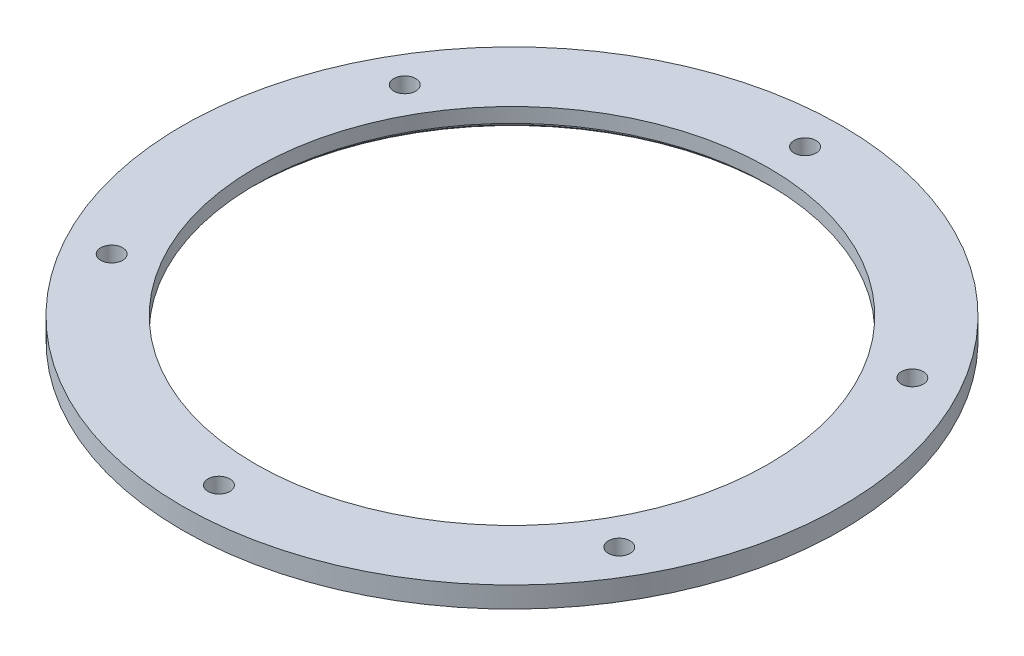
ISO-10303-21;
HEADER;
FILE_DESCRIPTION(('STEP AP214'),'2;1');
FILE_NAME('part.step','',(''),(''),'','','');
FILE_SCHEMA(('AUTOMOTIVE_DESIGN { 1 0 10303 214 1 1 1 1 }'));
ENDSEC;
DATA;
#1=APPLICATION_CONTEXT('core data for automotive mechanical design processes');
#2=APPLICATION_PROTOCOL_DEFINITION('international standard','automotive_design',2000,#1);
#3=PRODUCT_CONTEXT('',#1,'mechanical');
#4=PRODUCT('Part','Part','',(#3));
#5=PRODUCT_RELATED_PRODUCT_CATEGORY('part','',(#4));
#6=PRODUCT_DEFINITION_FORMATION('','',#4);
#7=PRODUCT_DEFINITION_CONTEXT('part definition',#1,'design');
#8=PRODUCT_DEFINITION('design','',#6,#7);
#9=PRODUCT_DEFINITION_SHAPE('','',#8);
#10=(LENGTH_UNIT() NAMED_UNIT(*) SI_UNIT(.MILLI.,.METRE.));
#11=(NAMED_UNIT(*) PLANE_ANGLE_UNIT() SI_UNIT($,.RADIAN.));
#12=(NAMED_UNIT(*) SI_UNIT($,.STERADIAN.) SOLID_ANGLE_UNIT());
#13=UNCERTAINTY_MEASURE_WITH_UNIT(LENGTH_MEASURE(1.E-05),#10,'distance_accuracy_value','');
#14=(GEOMETRIC_REPRESENTATION_CONTEXT(3) GLOBAL_UNCERTAINTY_ASSIGNED_CONTEXT((#13)) GLOBAL_UNIT_ASSIGNED_CONTEXT((#10,
#11,#12)) REPRESENTATION_CONTEXT('',''));
#15=CARTESIAN_POINT('',(0.,0.,0.));
#16=DIRECTION('',(0.,0.,1.));
#17=DIRECTION('',(1.,0.,0.));
#18=AXIS2_PLACEMENT_3D('',#15,#16,#17);
#19=CARTESIAN_POINT('',(0.,10.,0.));
#20=DIRECTION('',(0.,-1.,0.));
#21=DIRECTION('',(0.,0.,-1.));
#22=AXIS2_PLACEMENT_3D('',#19,#20,#21);
#23=CYLINDRICAL_SURFACE('',#22,123.);
#24=CARTESIAN_POINT('',(0.,10.,0.));
#25=DIRECTION('',(0.,1.,0.));
#26=DIRECTION('',(0.,0.,1.));
#27=AXIS2_PLACEMENT_3D('',#24,#25,#26);
#28=CIRCLE('',#27,123.);
#29=CARTESIAN_POINT('',(0.,10.,123.));
#30=VERTEX_POINT('',#29);
#31=EDGE_CURVE('E54',#30,#30,#28,.T.);
#32=ORIENTED_EDGE('',*,*,#31,.T.);
#33=EDGE_LOOP('',(#32));
#34=FACE_BOUND('',#33,.T.);
#35=CARTESIAN_POINT('',(0.,3.,0.));
#36=DIRECTION('',(0.,-1.,0.));
#37=DIRECTION('',(0.,0.,-1.));
#38=AXIS2_PLACEMENT_3D('',#35,#36,#37);
#39=CIRCLE('',#38,123.);
#40=CARTESIAN_POINT('',(0.,3.,-123.));
#41=VERTEX_POINT('',#40);
#42=EDGE_CURVE('E48',#41,#41,#39,.T.);
#43=ORIENTED_EDGE('',*,*,#42,.T.);
#44=EDGE_LOOP('',(#43));
#45=FACE_BOUND('',#44,.T.);
#46=ADVANCED_FACE('F30',(#34,#45),#23,.F.);
#47=CARTESIAN_POINT('',(0.,10.,0.));
#48=DIRECTION('',(0.,1.,0.));
#49=DIRECTION('',(0.,0.,1.));
#50=AXIS2_PLACEMENT_3D('',#47,#48,#49);
#51=PLANE('',#50);
#52=CARTESIAN_POINT('',(-121.676569231702,10.,70.250000000007));
#53=DIRECTION('',(0.,1.,0.));
#54=DIRECTION('',(0.,0.,1.));
#55=AXIS2_PLACEMENT_3D('',#52,#53,#54);
#56=CIRCLE('',#55,5.25000000001474);
#57=CARTESIAN_POINT('',(-121.676569231702,10.,75.5000000000217));
#58=VERTEX_POINT('',#57);
#59=EDGE_CURVE('E80',#58,#58,#56,.T.);
#60=ORIENTED_EDGE('',*,*,#59,.F.);
#61=EDGE_LOOP('',(#60));
#62=FACE_BOUND('',#61,.T.);
#63=CARTESIAN_POINT('',(121.676569231726,10.,70.2499999999931));
#64=DIRECTION('',(0.,1.,0.));
#65=DIRECTION('',(0.,0.,1.));
#66=AXIS2_PLACEMENT_3D('',#63,#64,#65);
#67=CIRCLE('',#66,5.25000000001009);
#68=CARTESIAN_POINT('',(121.676569231726,10.,75.5000000000032));
#69=VERTEX_POINT('',#68);
#70=EDGE_CURVE('E68',#69,#69,#67,.T.);
#71=ORIENTED_EDGE('',*,*,#70,.F.);
#72=EDGE_LOOP('',(#71));
#73=FACE_BOUND('',#72,.T.);
#74=CARTESIAN_POINT('',(0.,10.,-140.5));
#75=DIRECTION('',(0.,1.,0.));
#76=DIRECTION('',(0.,0.,1.));
#77=AXIS2_PLACEMENT_3D('',#74,#75,#76);
#78=CIRCLE('',#77,5.25);
#79=CARTESIAN_POINT('',(0.,10.,-135.25));
#80=VERTEX_POINT('',#79);
#81=EDGE_CURVE('E58',#80,#80,#78,.T.);
#82=ORIENTED_EDGE('',*,*,#81,.F.);
#83=EDGE_LOOP('',(#82));
#84=FACE_BOUND('',#83,.T.);
#85=CARTESIAN_POINT('',(0.,10.,0.));
#86=DIRECTION('',(0.,1.,0.));
#87=DIRECTION('',(0.,0.,1.));
#88=AXIS2_PLACEMENT_3D('',#85,#86,#87);
#89=CIRCLE('',#88,158.);
#90=CARTESIAN_POINT('',(0.,10.,158.));
#91=VERTEX_POINT('',#90);
#92=EDGE_CURVE('E41',#91,#91,#89,.T.);
#93=ORIENTED_EDGE('',*,*,#92,.T.);
#94=EDGE_LOOP('',(#93));
#95=FACE_BOUND('',#94,.T.);
#96=ORIENTED_EDGE('',*,*,#31,.F.);
#97=EDGE_LOOP('',(#96));
#98=FACE_BOUND('',#97,.T.);
#99=CARTESIAN_POINT('',(121.676569231718,10.,-70.2500000000069));
#100=DIRECTION('',(0.,1.,0.));
#101=DIRECTION('',(0.,0.,1.));
#102=AXIS2_PLACEMENT_3D('',#99,#100,#101);
#103=CIRCLE('',#102,5.25000000000215);
#104=CARTESIAN_POINT('',(121.676569231718,10.,-65.0000000000048));
#105=VERTEX_POINT('',#104);
#106=EDGE_CURVE('E62',#105,#105,#103,.T.);
#107=ORIENTED_EDGE('',*,*,#106,.F.);
#108=EDGE_LOOP('',(#107));
#109=FACE_BOUND('',#108,.T.);
#110=CARTESIAN_POINT('',(1.5938588124831E-11,10.,140.5));
#111=DIRECTION('',(0.,1.,0.));
#112=DIRECTION('',(0.,0.,1.));
#113=AXIS2_PLACEMENT_3D('',#110,#111,#112);
#114=CIRCLE('',#113,5.25000000001619);
#115=CARTESIAN_POINT('',(1.5938588124831E-11,10.,145.750000000016));
#116=VERTEX_POINT('',#115);
#117=EDGE_CURVE('E74',#116,#116,#114,.T.);
#118=ORIENTED_EDGE('',*,*,#117,.F.);
#119=EDGE_LOOP('',(#118));
#120=FACE_BOUND('',#119,.T.);
#121=CARTESIAN_POINT('',(-121.67656923171,10.,-70.249999999993));
#122=DIRECTION('',(0.,1.,0.));
#123=DIRECTION('',(0.,0.,1.));
#124=AXIS2_PLACEMENT_3D('',#121,#122,#123);
#125=CIRCLE('',#124,5.2500000000075);
#126=CARTESIAN_POINT('',(-121.67656923171,10.,-64.9999999999855));
#127=VERTEX_POINT('',#126);
#128=EDGE_CURVE('E86',#127,#127,#125,.T.);
#129=ORIENTED_EDGE('',*,*,#128,.F.);
#130=EDGE_LOOP('',(#129));
#131=FACE_BOUND('',#130,.T.);
#132=ADVANCED_FACE('F112',(#62,#73,#84,#95,#98,#109,#120,#131),#51,.T.);
#133=CARTESIAN_POINT('',(0.,0.,0.));
#134=DIRECTION('',(0.,1.,0.));
#135=DIRECTION('',(0.,0.,1.));
#136=AXIS2_PLACEMENT_3D('',#133,#134,#135);
#137=PLANE('',#136);
#138=CARTESIAN_POINT('',(0.,0.,0.));
#139=DIRECTION('',(0.,1.,0.));
#140=DIRECTION('',(0.,0.,1.));
#141=AXIS2_PLACEMENT_3D('',#138,#139,#140);
#142=CIRCLE('',#141,126.);
#143=CARTESIAN_POINT('',(0.,0.,126.));
#144=VERTEX_POINT('',#143);
#145=EDGE_CURVE('E10',#144,#144,#142,.T.);
#146=ORIENTED_EDGE('',*,*,#145,.T.);
#147=EDGE_LOOP('',(#146));
#148=FACE_BOUND('',#147,.T.);
#149=CARTESIAN_POINT('',(0.,0.,0.));
#150=DIRECTION('',(0.,1.,0.));
#151=DIRECTION('',(0.,0.,1.));
#152=AXIS2_PLACEMENT_3D('',#149,#150,#151);
#153=CIRCLE('',#152,158.);
#154=CARTESIAN_POINT('',(0.,0.,158.));
#155=VERTEX_POINT('',#154);
#156=EDGE_CURVE('E45',#155,#155,#153,.T.);
#157=ORIENTED_EDGE('',*,*,#156,.F.);
#158=EDGE_LOOP('',(#157));
#159=FACE_BOUND('',#158,.T.);
#160=CARTESIAN_POINT('',(0.,0.,-140.5));
#161=DIRECTION('',(0.,1.,0.));
#162=DIRECTION('',(0.,0.,1.));
#163=AXIS2_PLACEMENT_3D('',#160,#161,#162);
#164=CIRCLE('',#163,5.25);
#165=CARTESIAN_POINT('',(0.,0.,-135.25));
#166=VERTEX_POINT('',#165);
#167=EDGE_CURVE('E59',#166,#166,#164,.T.);
#168=ORIENTED_EDGE('',*,*,#167,.T.);
#169=EDGE_LOOP('',(#168));
#170=FACE_BOUND('',#169,.T.);
#171=CARTESIAN_POINT('',(121.676569231718,0.,-70.2500000000069));
#172=DIRECTION('',(0.,1.,0.));
#173=DIRECTION('',(0.,0.,1.));
#174=AXIS2_PLACEMENT_3D('',#171,#172,#173);
#175=CIRCLE('',#174,5.25000000000215);
#176=CARTESIAN_POINT('',(121.676569231718,0.,-65.0000000000048));
#177=VERTEX_POINT('',#176);
#178=EDGE_CURVE('E65',#177,#177,#175,.T.);
#179=ORIENTED_EDGE('',*,*,#178,.T.);
#180=EDGE_LOOP('',(#179));
#181=FACE_BOUND('',#180,.T.);
#182=CARTESIAN_POINT('',(121.676569231726,0.,70.2499999999931));
#183=DIRECTION('',(0.,1.,0.));
#184=DIRECTION('',(0.,0.,1.));
#185=AXIS2_PLACEMENT_3D('',#182,#183,#184);
#186=CIRCLE('',#185,5.25000000001009);
#187=CARTESIAN_POINT('',(121.676569231726,0.,75.5000000000032));
#188=VERTEX_POINT('',#187);
#189=EDGE_CURVE('E71',#188,#188,#186,.T.);
#190=ORIENTED_EDGE('',*,*,#189,.T.);
#191=EDGE_LOOP('',(#190));
#192=FACE_BOUND('',#191,.T.);
#193=CARTESIAN_POINT('',(1.5938588124831E-11,0.,140.5));
#194=DIRECTION('',(0.,1.,0.));
#195=DIRECTION('',(0.,0.,1.));
#196=AXIS2_PLACEMENT_3D('',#193,#194,#195);
#197=CIRCLE('',#196,5.25000000001619);
#198=CARTESIAN_POINT('',(1.5938588124831E-11,0.,145.750000000016));
#199=VERTEX_POINT('',#198);
#200=EDGE_CURVE('E77',#199,#199,#197,.T.);
#201=ORIENTED_EDGE('',*,*,#200,.T.);
#202=EDGE_LOOP('',(#201));
#203=FACE_BOUND('',#202,.T.);
#204=CARTESIAN_POINT('',(-121.676569231702,0.,70.250000000007));
#205=DIRECTION('',(0.,1.,0.));
#206=DIRECTION('',(0.,0.,1.));
#207=AXIS2_PLACEMENT_3D('',#204,#205,#206);
#208=CIRCLE('',#207,5.25000000001474);
#209=CARTESIAN_POINT('',(-121.676569231702,0.,75.5000000000217));
#210=VERTEX_POINT('',#209);
#211=EDGE_CURVE('E83',#210,#210,#208,.T.);
#212=ORIENTED_EDGE('',*,*,#211,.T.);
#213=EDGE_LOOP('',(#212));
#214=FACE_BOUND('',#213,.T.);
#215=CARTESIAN_POINT('',(-121.67656923171,0.,-70.249999999993));
#216=DIRECTION('',(0.,1.,0.));
#217=DIRECTION('',(0.,0.,1.));
#218=AXIS2_PLACEMENT_3D('',#215,#216,#217);
#219=CIRCLE('',#218,5.2500000000075);
#220=CARTESIAN_POINT('',(-121.67656923171,0.,-64.9999999999855));
#221=VERTEX_POINT('',#220);
#222=EDGE_CURVE('E51',#221,#221,#219,.T.);
#223=ORIENTED_EDGE('',*,*,#222,.T.);
#224=EDGE_LOOP('',(#223));
#225=FACE_BOUND('',#224,.T.);
#226=ADVANCED_FACE('F118',(#148,#159,#170,#181,#192,#203,#214,#225),#137,.F.);
#227=CARTESIAN_POINT('',(0.,10.,0.));
#228=DIRECTION('',(0.,-1.,0.));
#229=DIRECTION('',(0.,0.,-1.));
#230=AXIS2_PLACEMENT_3D('',#227,#228,#229);
#231=CYLINDRICAL_SURFACE('',#230,158.);
#232=ORIENTED_EDGE('',*,*,#92,.F.);
#233=EDGE_LOOP('',(#232));
#234=FACE_BOUND('',#233,.T.);
#235=ORIENTED_EDGE('',*,*,#156,.T.);
#236=EDGE_LOOP('',(#235));
#237=FACE_BOUND('',#236,.T.);
#238=ADVANCED_FACE('F127',(#234,#237),#231,.T.);
#239=CARTESIAN_POINT('',(0.,10.,-140.5));
#240=DIRECTION('',(0.,-1.,0.));
#241=DIRECTION('',(0.,0.,-1.));
#242=AXIS2_PLACEMENT_3D('',#239,#240,#241);
#243=CYLINDRICAL_SURFACE('',#242,5.25);
#244=ORIENTED_EDGE('',*,*,#81,.T.);
#245=EDGE_LOOP('',(#244));
#246=FACE_BOUND('',#245,.T.);
#247=ORIENTED_EDGE('',*,*,#167,.F.);
#248=EDGE_LOOP('',(#247));
#249=FACE_BOUND('',#248,.T.);
#250=ADVANCED_FACE('F123',(#246,#249),#243,.F.);
#251=CARTESIAN_POINT('',(121.676569231718,10.,-70.2500000000069));
#252=DIRECTION('',(0.,-1.,0.));
#253=DIRECTION('',(0.,0.,-1.));
#254=AXIS2_PLACEMENT_3D('',#251,#252,#253);
#255=CYLINDRICAL_SURFACE('',#254,5.25000000000215);
#256=ORIENTED_EDGE('',*,*,#106,.T.);
#257=EDGE_LOOP('',(#256));
#258=FACE_BOUND('',#257,.T.);
#259=ORIENTED_EDGE('',*,*,#178,.F.);
#260=EDGE_LOOP('',(#259));
#261=FACE_BOUND('',#260,.T.);
#262=ADVANCED_FACE('F133',(#258,#261),#255,.F.);
#263=CARTESIAN_POINT('',(121.676569231726,10.,70.2499999999931));
#264=DIRECTION('',(0.,-1.,0.));
#265=DIRECTION('',(0.,0.,-1.));
#266=AXIS2_PLACEMENT_3D('',#263,#264,#265);
#267=CYLINDRICAL_SURFACE('',#266,5.25000000001009);
#268=ORIENTED_EDGE('',*,*,#70,.T.);
#269=EDGE_LOOP('',(#268));
#270=FACE_BOUND('',#269,.T.);
#271=ORIENTED_EDGE('',*,*,#189,.F.);
#272=EDGE_LOOP('',(#271));
#273=FACE_BOUND('',#272,.T.);
#274=ADVANCED_FACE('F160',(#270,#273),#267,.F.);
#275=CARTESIAN_POINT('',(1.5938588124831E-11,10.,140.5));
#276=DIRECTION('',(0.,-1.,0.));
#277=DIRECTION('',(0.,0.,-1.));
#278=AXIS2_PLACEMENT_3D('',#275,#276,#277);
#279=CYLINDRICAL_SURFACE('',#278,5.25000000001619);
#280=ORIENTED_EDGE('',*,*,#117,.T.);
#281=EDGE_LOOP('',(#280));
#282=FACE_BOUND('',#281,.T.);
#283=ORIENTED_EDGE('',*,*,#200,.F.);
#284=EDGE_LOOP('',(#283));
#285=FACE_BOUND('',#284,.T.);
#286=ADVANCED_FACE('F154',(#282,#285),#279,.F.);
#287=CARTESIAN_POINT('',(-121.676569231702,10.,70.250000000007));
#288=DIRECTION('',(0.,-1.,0.));
#289=DIRECTION('',(0.,0.,-1.));
#290=AXIS2_PLACEMENT_3D('',#287,#288,#289);
#291=CYLINDRICAL_SURFACE('',#290,5.25000000001474);
#292=ORIENTED_EDGE('',*,*,#59,.T.);
#293=EDGE_LOOP('',(#292));
#294=FACE_BOUND('',#293,.T.);
#295=ORIENTED_EDGE('',*,*,#211,.F.);
#296=EDGE_LOOP('',(#295));
#297=FACE_BOUND('',#296,.T.);
#298=ADVANCED_FACE('F108',(#294,#297),#291,.F.);
#299=CARTESIAN_POINT('',(-121.67656923171,10.,-70.249999999993));
#300=DIRECTION('',(0.,-1.,0.));
#301=DIRECTION('',(0.,0.,-1.));
#302=AXIS2_PLACEMENT_3D('',#299,#300,#301);
#303=CYLINDRICAL_SURFACE('',#302,5.2500000000075);
#304=ORIENTED_EDGE('',*,*,#128,.T.);
#305=EDGE_LOOP('',(#304));
#306=FACE_BOUND('',#305,.T.);
#307=ORIENTED_EDGE('',*,*,#222,.F.);
#308=EDGE_LOOP('',(#307));
#309=FACE_BOUND('',#308,.T.);
#310=ADVANCED_FACE('F100',(#306,#309),#303,.F.);
#311=CARTESIAN_POINT('',(0.,3.,0.));
#312=DIRECTION('',(0.,-1.,0.));
#313=DIRECTION('',(0.,0.,-1.));
#314=AXIS2_PLACEMENT_3D('',#311,#312,#313);
#315=CYLINDRICAL_SURFACE('',#314,125.);
#316=CARTESIAN_POINT('',(0.,1.00000000000004,0.));
#317=DIRECTION('',(0.,1.,0.));
#318=DIRECTION('',(0.,0.,1.));
#319=AXIS2_PLACEMENT_3D('',#316,#317,#318);
#320=CIRCLE('',#319,125.);
#321=CARTESIAN_POINT('',(0.,1.00000000000004,125.));
#322=VERTEX_POINT('',#321);
#323=EDGE_CURVE('E37',#322,#322,#320,.F.);
#324=ORIENTED_EDGE('',*,*,#323,.T.);
#325=EDGE_LOOP('',(#324));
#326=FACE_BOUND('',#325,.T.);
#327=CARTESIAN_POINT('',(0.,3.,0.));
#328=DIRECTION('',(0.,-1.,0.));
#329=DIRECTION('',(0.,0.,-1.));
#330=AXIS2_PLACEMENT_3D('',#327,#328,#329);
#331=CIRCLE('',#330,125.);
#332=CARTESIAN_POINT('',(0.,3.,-125.));
#333=VERTEX_POINT('',#332);
#334=EDGE_CURVE('E52',#333,#333,#331,.T.);
#335=ORIENTED_EDGE('',*,*,#334,.F.);
#336=EDGE_LOOP('',(#335));
#337=FACE_BOUND('',#336,.T.);
#338=ADVANCED_FACE('F98',(#326,#337),#315,.F.);
#339=CARTESIAN_POINT('',(0.,3.,0.));
#340=DIRECTION('',(0.,-1.,0.));
#341=DIRECTION('',(0.,0.,-1.));
#342=AXIS2_PLACEMENT_3D('',#339,#340,#341);
#343=PLANE('',#342);
#344=ORIENTED_EDGE('',*,*,#42,.F.);
#345=EDGE_LOOP('',(#344));
#346=FACE_BOUND('',#345,.T.);
#347=ORIENTED_EDGE('',*,*,#334,.T.);
#348=EDGE_LOOP('',(#347));
#349=FACE_BOUND('',#348,.T.);
#350=ADVANCED_FACE('F96',(#346,#349),#343,.T.);
#351=CARTESIAN_POINT('',(0.,1.00000000000004,0.));
#352=DIRECTION('',(0.,-1.,0.));
#353=DIRECTION('',(0.,0.,-1.));
#354=AXIS2_PLACEMENT_3D('',#351,#352,#353);
#355=CONICAL_SURFACE('',#354,125.,0.785398163397455);
#356=ORIENTED_EDGE('',*,*,#145,.F.);
#357=EDGE_LOOP('',(#356));
#358=FACE_BOUND('',#357,.T.);
#359=ORIENTED_EDGE('',*,*,#323,.F.);
#360=EDGE_LOOP('',(#359));
#361=FACE_BOUND('',#360,.T.);
#362=ADVANCED_FACE('F32',(#358,#361),#355,.F.);
#363=CLOSED_SHELL('',(#46,#132,#226,#238,#250,#262,#274,#286,#298,#310,#338,#350,#362));
#364=MANIFOLD_SOLID_BREP('B2',#363);
#365=ADVANCED_BREP_SHAPE_REPRESENTATION('',(#18,#364),#14);
#366=SHAPE_DEFINITION_REPRESENTATION(#9,#365);
ENDSEC;
END-ISO-10303-21;
